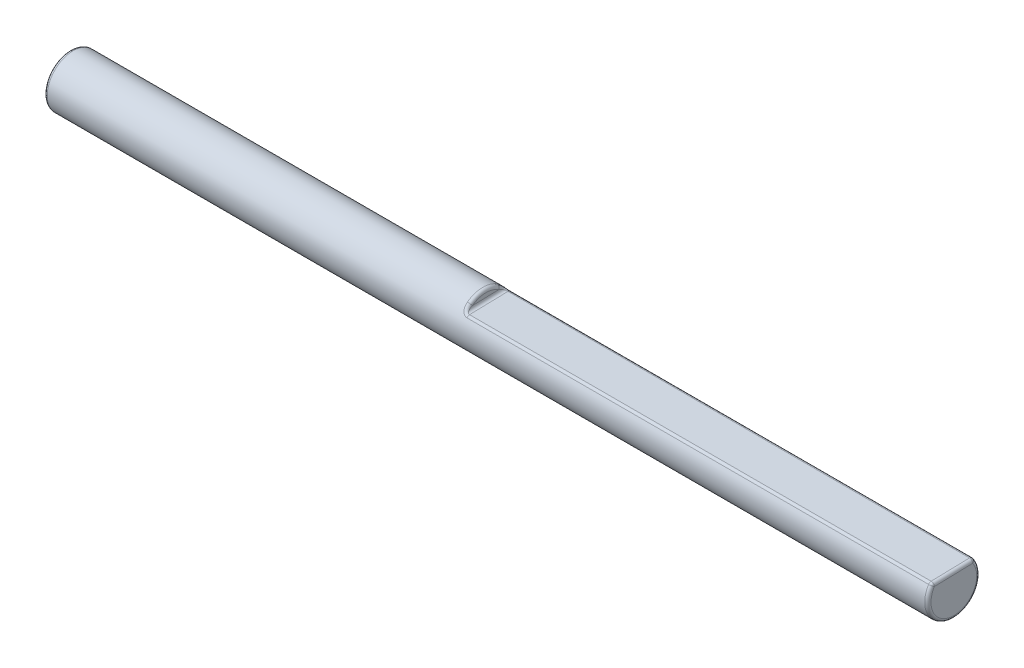
ISO-10303-21;
HEADER;
FILE_DESCRIPTION(('STEP AP214'),'2;1');
FILE_NAME('part.step','',(''),(''),'','','');
FILE_SCHEMA(('AUTOMOTIVE_DESIGN { 1 0 10303 214 1 1 1 1 }'));
ENDSEC;
DATA;
#1=APPLICATION_CONTEXT('core data for automotive mechanical design processes');
#2=APPLICATION_PROTOCOL_DEFINITION('international standard','automotive_design',2000,#1);
#3=PRODUCT_CONTEXT('',#1,'mechanical');
#4=PRODUCT('Part','Part','',(#3));
#5=PRODUCT_RELATED_PRODUCT_CATEGORY('part','',(#4));
#6=PRODUCT_DEFINITION_FORMATION('','',#4);
#7=PRODUCT_DEFINITION_CONTEXT('part definition',#1,'design');
#8=PRODUCT_DEFINITION('design','',#6,#7);
#9=PRODUCT_DEFINITION_SHAPE('','',#8);
#10=(LENGTH_UNIT() NAMED_UNIT(*) SI_UNIT(.MILLI.,.METRE.));
#11=(NAMED_UNIT(*) PLANE_ANGLE_UNIT() SI_UNIT($,.RADIAN.));
#12=(NAMED_UNIT(*) SI_UNIT($,.STERADIAN.) SOLID_ANGLE_UNIT());
#13=UNCERTAINTY_MEASURE_WITH_UNIT(LENGTH_MEASURE(1.E-05),#10,'distance_accuracy_value','');
#14=(GEOMETRIC_REPRESENTATION_CONTEXT(3) GLOBAL_UNCERTAINTY_ASSIGNED_CONTEXT((#13)) GLOBAL_UNIT_ASSIGNED_CONTEXT((#10,
#11,#12)) REPRESENTATION_CONTEXT('',''));
#15=CARTESIAN_POINT('',(0.,0.,0.));
#16=DIRECTION('',(0.,0.,1.));
#17=DIRECTION('',(1.,0.,0.));
#18=AXIS2_PLACEMENT_3D('',#15,#16,#17);
#19=CARTESIAN_POINT('',(107.95,0.,0.));
#20=DIRECTION('',(-1.,0.,0.));
#21=DIRECTION('',(0.,0.,1.));
#22=AXIS2_PLACEMENT_3D('',#19,#20,#21);
#23=CYLINDRICAL_SURFACE('',#22,3.175);
#24=CARTESIAN_POINT('',(0.381000000000006,0.,0.));
#25=DIRECTION('',(1.,0.,0.));
#26=DIRECTION('',(0.,0.,-1.));
#27=AXIS2_PLACEMENT_3D('',#24,#25,#26);
#28=CIRCLE('',#27,3.175);
#29=CARTESIAN_POINT('',(0.381000000000006,0.,-3.175));
#30=VERTEX_POINT('',#29);
#31=EDGE_CURVE('E297',#30,#30,#28,.T.);
#32=ORIENTED_EDGE('',*,*,#31,.T.);
#33=EDGE_LOOP('',(#32));
#34=FACE_BOUND('',#33,.T.);
#35=CARTESIAN_POINT('',(51.2889113464813,1.86061677622849,2.36945052063749));
#36=CARTESIAN_POINT('',(51.3264620396878,1.8664609920511,2.57606934951021));
#37=CARTESIAN_POINT('',(51.3968226929626,1.69924548178732,2.68201226556207));
#38=CARTESIAN_POINT('',(51.2716276856336,1.85531270441578,2.37616676666429));
#39=CARTESIAN_POINT('',(51.303375282423,1.85749105612046,2.58277024156461));
#40=CARTESIAN_POINT('',(51.3622553712666,1.68738842412367,2.68949626337339));
#41=CARTESIAN_POINT('',(51.253810924238,1.85128223441124,2.38121692365727));
#42=CARTESIAN_POINT('',(51.2793882237581,1.85068500253967,2.58781753681003));
#43=CARTESIAN_POINT('',(51.3266218484758,1.67837691595813,2.69512250049785));
#44=CARTESIAN_POINT('',(51.2176628451154,1.84587687221378,2.38795387459997));
#45=CARTESIAN_POINT('',(51.2306157818434,1.84157359403442,2.59454953766819));
#46=CARTESIAN_POINT('',(51.254325690231,1.66629032446794,2.70262711959848));
#47=CARTESIAN_POINT('',(51.1993321068419,1.84449910257518,2.38964431297881));
#48=CARTESIAN_POINT('',(51.2058012442463,1.83925197265389,2.59624634845099));
#49=CARTESIAN_POINT('',(51.2176642136843,1.66320880874467,2.70450956262816));
#50=CARTESIAN_POINT('',(51.1624786529568,1.84449552930852,2.38964534121022));
#51=CARTESIAN_POINT('',(51.1559427111945,1.83924541956583,2.59624879138466));
#52=CARTESIAN_POINT('',(51.143957305913,1.66320071994776,2.70451062871122));
#53=CARTESIAN_POINT('',(51.1439559089441,1.84589828072248,2.3879208611442));
#54=CARTESIAN_POINT('',(51.1308680865988,1.84160861468443,2.59451922324205));
#55=CARTESIAN_POINT('',(51.1069118178863,1.66633801200165,2.70259019769311));
#56=CARTESIAN_POINT('',(51.1074745013587,1.85142600111972,2.38104446763984));
#57=CARTESIAN_POINT('',(51.0816486169153,1.85092869396238,2.58764220598248));
#58=CARTESIAN_POINT('',(51.0339490027194,1.67869857779526,2.69493054907568));
#59=CARTESIAN_POINT('',(51.0895156565798,1.8555500860408,2.37589366728384));
#60=CARTESIAN_POINT('',(51.0574728002052,1.85789594340085,2.5824870818938));
#61=CARTESIAN_POINT('',(50.9980313131668,1.68791987506303,2.68919257165323));
#62=CARTESIAN_POINT('',(51.0547078075911,1.86628287038285,2.36224541373698));
#63=CARTESIAN_POINT('',(51.0109290954819,1.87606450098341,2.56887370326151));
#64=CARTESIAN_POINT('',(50.928415615175,1.71191094840253,2.67398282988706));
#65=CARTESIAN_POINT('',(51.0378561737102,1.87288541272295,2.35375625136794));
#66=CARTESIAN_POINT('',(50.9885283498056,1.88727939537419,2.56040524868403));
#67=CARTESIAN_POINT('',(50.8947123473936,1.72666697481243,2.66452031537807));
#68=CARTESIAN_POINT('',(51.0056058699795,1.88824233783816,2.33353659065094));
#69=CARTESIAN_POINT('',(50.9461400200386,1.91343730516875,2.54031499979632));
#70=CARTESIAN_POINT('',(50.8302117399579,1.76097448524634,2.641971655952));
#71=CARTESIAN_POINT('',(50.9902095857453,1.89700017172521,2.32180089007985));
#72=CARTESIAN_POINT('',(50.9261330136026,1.92842247979147,2.52865914842708));
#73=CARTESIAN_POINT('',(50.7994191715348,1.7805336600944,2.62887969517106));
#74=CARTESIAN_POINT('',(50.9607241196294,1.91655090994752,2.29484670019643));
#75=CARTESIAN_POINT('',(50.8885031415294,1.96198733713377,2.50200106090461));
#76=CARTESIAN_POINT('',(50.740448239213,1.82417519910743,2.59879421738565));
#77=CARTESIAN_POINT('',(50.9466938216674,1.92740079294856,2.27952725029035));
#78=CARTESIAN_POINT('',(50.8709667890501,1.98071569139524,2.48686134279981));
#79=CARTESIAN_POINT('',(50.7123876431477,1.84838410573956,2.58168754224174));
#80=CARTESIAN_POINT('',(50.92069636433,1.95044233090003,2.24590286258762));
#81=CARTESIAN_POINT('',(50.8394282094077,2.02063141439924,2.45378195785048));
#82=CARTESIAN_POINT('',(50.660392728466,1.89976428689574,2.54411811476548));
#83=CARTESIAN_POINT('',(50.90873157848,1.96263550345286,2.22759453657761));
#84=CARTESIAN_POINT('',(50.8254278039632,2.04188053771935,2.43578407032227));
#85=CARTESIAN_POINT('',(50.6364631569006,1.92693891165497,2.52365155349101));
#86=CARTESIAN_POINT('',(50.8827938803284,1.99264886394887,2.1808885782048));
#87=CARTESIAN_POINT('',(50.7964779101286,2.0944753687885,2.38998506591887));
#88=CARTESIAN_POINT('',(50.5845877607386,1.99378163171356,2.47140825448484));
#89=CARTESIAN_POINT('',(50.8697674359335,2.01085591234255,2.15129100670113));
#90=CARTESIAN_POINT('',(50.7832722093846,2.12660683697859,2.36102216723602));
#91=CARTESIAN_POINT('',(50.5585348718877,2.03429405335518,2.43827823086114));
#92=CARTESIAN_POINT('',(50.8474914781523,2.04782943375369,2.08793927786675));
#93=CARTESIAN_POINT('',(50.763655442702,2.1921565369996,2.29941171032207));
#94=CARTESIAN_POINT('',(50.5139829562839,2.11646998902107,2.36730788375925));
#95=CARTESIAN_POINT('',(50.8382463028738,2.06659652295876,2.05418040386822));
#96=CARTESIAN_POINT('',(50.7573419075053,2.22571762123843,2.26658152208576));
#97=CARTESIAN_POINT('',(50.4954926057465,2.1581347669446,2.32946221475156));
#98=CARTESIAN_POINT('',(50.8200767324406,2.11127559581753,1.96934888447875));
#99=CARTESIAN_POINT('',(50.7495916814408,2.30634325466988,2.18416014327291));
#100=CARTESIAN_POINT('',(50.4591534648827,2.25719798063517,2.23428957702656));
#101=CARTESIAN_POINT('',(50.8127131041597,2.13709014841927,1.91669422351017));
#102=CARTESIAN_POINT('',(50.7514088708258,2.35328761028631,2.1331392674937));
#103=CARTESIAN_POINT('',(50.4444262082862,2.31432941245922,2.17516089294884));
#104=CARTESIAN_POINT('',(50.8029629166156,2.18716484872636,1.80640004855309));
#105=CARTESIAN_POINT('',(50.7649453938521,2.44503082507211,2.02690729169339));
#106=CARTESIAN_POINT('',(50.4249258332647,2.42491686404693,2.05119042107963));
#107=CARTESIAN_POINT('',(50.8006063710277,2.21141478255827,1.74873261886379));
#108=CARTESIAN_POINT('',(50.7771512057677,2.48993644770661,1.97126510354332));
#109=CARTESIAN_POINT('',(50.4202127421912,2.47834887258039,1.9863165957711));
#110=CARTESIAN_POINT('',(50.7996997300512,2.25308918931056,1.64154501717415));
#111=CARTESIAN_POINT('',(50.8063065780548,2.5675813512571,1.86856339253273));
#112=CARTESIAN_POINT('',(50.4183994599932,2.56994052925047,1.86563624935162));
#113=CARTESIAN_POINT('',(50.8004940123679,2.27091978608572,1.59264377162257));
#114=CARTESIAN_POINT('',(50.8222093303457,2.60124831444893,1.82140194567038));
#115=CARTESIAN_POINT('',(50.4199880243634,2.60904074450168,1.81054522403829));
#116=CARTESIAN_POINT('',(50.8038892506501,2.30498944125461,1.49291444033795));
#117=CARTESIAN_POINT('',(50.8585085124755,2.66631382468721,1.72508979460887));
#118=CARTESIAN_POINT('',(50.4267785009295,2.68356961941779,1.69812625423315));
#119=CARTESIAN_POINT('',(50.8064925353414,2.32122641740139,1.44208395091787));
#120=CARTESIAN_POINT('',(50.8791200444994,2.69765457973563,1.67579499349746));
#121=CARTESIAN_POINT('',(50.4319850705777,2.718993478883,1.64079551644433));
#122=CARTESIAN_POINT('',(50.8129252595926,2.35173838787002,1.33979125008394));
#123=CARTESIAN_POINT('',(50.9236828364736,2.75740753118696,1.57615280226639));
#124=CARTESIAN_POINT('',(50.4448505192883,2.78536536104796,1.52535910882584));
#125=CARTESIAN_POINT('',(50.8167316771751,2.36604354938308,1.28835707996335));
#126=CARTESIAN_POINT('',(50.9477540223914,2.78579308492648,1.52569960894811));
#127=CARTESIAN_POINT('',(50.4524633544017,2.81638273242603,1.46728619497698));
#128=CARTESIAN_POINT('',(50.8251335397235,2.3929742143745,1.18429308388462));
#129=CARTESIAN_POINT('',(50.9988637336602,2.84029317299343,1.42251192748724));
#130=CARTESIAN_POINT('',(50.4692670793957,2.87456680695641,1.34973233304561));
#131=CARTESIAN_POINT('',(50.8297267183352,2.40560436247825,1.13166705892288));
#132=CARTESIAN_POINT('',(51.0260182991249,2.86629149250079,1.36970693172966));
#133=CARTESIAN_POINT('',(50.4784534365679,2.90174417233005,1.29025584106035));
#134=CARTESIAN_POINT('',(50.8345010351724,2.41740942277435,1.07845527244791));
#135=CARTESIAN_POINT('',(51.053542503335,2.89057483799126,1.31683559197639));
#136=CARTESIAN_POINT('',(50.4880020703448,2.92703004363376,1.23008947791018));
#137=(BOUNDED_SURFACE() B_SPLINE_SURFACE(3,2,((#35,#36,#37),(#38,#39,#40),(#41,#42,#43),(#44,
#45,#46),(#47,#48,#49),(#50,#51,#52),(#53,#54,#55),(#56,#57,#58),(#59,#60,#61),(#62,#63,#64),
(#65,#66,#67),(#68,#69,#70),(#71,#72,#73),(#74,#75,#76),(#77,#78,#79),(#80,#81,#82),(#83,#84,
#85),(#86,#87,#88),(#89,#90,#91),(#92,#93,#94),(#95,#96,#97),(#98,#99,#100),(#101,#102,#103),
(#104,#105,#106),(#107,#108,#109),(#110,#111,#112),(#113,#114,#115),(#116,#117,#118),(#119,#120,
#121),(#122,#123,#124),(#125,#126,#127),(#128,#129,#130),(#131,#132,#133),(#134,#135,#136)),
.UNSPECIFIED.,.F.,.F.,.F.) B_SPLINE_SURFACE_WITH_KNOTS((4,2,2,2,2,2,2,2,2,2,2,2,2,2,2,2,4),(3,
3),(0.,0.109979605014101,0.219839845237583,0.330834159910739,0.441792434311733,
0.552476866686738,0.663339696503116,0.777812327617677,0.892415638572016,1.05027319729736,
1.20831135545631,1.42859982924447,1.65020508343154,1.82836901100806,2.00676271461984,
2.18193077376075,2.35660247596007),(0.,1.),
.UNSPECIFIED.) GEOMETRIC_REPRESENTATION_ITEM() RATIONAL_B_SPLINE_SURFACE(((1.,0.875696525181189,
1.),(1.,0.876819204022841,1.),(1.,0.877647414738648,1.),(1.,0.87874140112617,1.),(1.,
0.87900778625312,1.),(1.,0.879006937081256,1.),(1.,0.878734165904822,1.),(1.,0.877621403045872,
1.),(1.,0.876781595570751,1.),(1.,0.874483221090066,1.),(1.,0.873026186281496,1.),(1.,
0.869421553804353,1.),(1.,0.867272846894886,1.),(1.,0.862141294560382,1.),(1.,0.859133566871117,
1.),(1.,0.852278123703959,1.),(1.,0.848429453231229,1.),(1.,0.838277208471231,1.),(1.,
0.831595334164917,1.),(1.,0.816756892948541,1.),(1.,0.808598647638926,1.),(1.,0.78754094815492,
1.),(1.,0.774039732630418,1.),(1.,0.745150665958184,1.),(1.,0.729752019803922,1.),(1.,
0.700926713202263,1.),(1.,0.687705220781478,1.),(1.,0.660816578297559,1.),(1.,0.647148875465996,
1.),(1.,0.619959656878175,1.),(1.,0.60643996640438,1.),(1.,0.579679073015139,1.),(1.,
0.566437189530008,1.),(1.,0.553482817324469,1.))) REPRESENTATION_ITEM('') SURFACE());
#138=CARTESIAN_POINT('',(50.4880020703448,2.92703004363376,1.23008947791018));
#139=CARTESIAN_POINT('',(50.4784534365679,2.90174417233005,1.29025584106035));
#140=CARTESIAN_POINT('',(50.4692670793957,2.87456680695641,1.34973233304561));
#141=CARTESIAN_POINT('',(50.4524633544017,2.81638273242603,1.46728619497698));
#142=CARTESIAN_POINT('',(50.4448505192883,2.78536536104796,1.52535910882584));
#143=CARTESIAN_POINT('',(50.4319850705777,2.71899347888301,1.64079551644433));
#144=CARTESIAN_POINT('',(50.4267785009295,2.68356961941779,1.69812625423315));
#145=CARTESIAN_POINT('',(50.4199880243634,2.60904074450168,1.81054522403829));
#146=CARTESIAN_POINT('',(50.4183994599932,2.56994052925047,1.86563624935162));
#147=CARTESIAN_POINT('',(50.4202127421912,2.47834887258039,1.9863165957711));
#148=CARTESIAN_POINT('',(50.4249258332647,2.42491686404693,2.05119042107963));
#149=CARTESIAN_POINT('',(50.4444262082862,2.31432941245922,2.17516089294884));
#150=CARTESIAN_POINT('',(50.4591534648827,2.25719798063517,2.23428957702656));
#151=CARTESIAN_POINT('',(50.4954926057465,2.1581347669446,2.32946221475156));
#152=CARTESIAN_POINT('',(50.5139829562839,2.11646998902107,2.36730788375925));
#153=CARTESIAN_POINT('',(50.5585348718877,2.03429405335518,2.43827823086114));
#154=CARTESIAN_POINT('',(50.5845877607386,1.99378163171356,2.47140825448484));
#155=CARTESIAN_POINT('',(50.6364631569006,1.92693891165497,2.52365155349101));
#156=CARTESIAN_POINT('',(50.660392728466,1.89976428689574,2.54411811476548));
#157=CARTESIAN_POINT('',(50.7123876431477,1.84838410573956,2.58168754224174));
#158=CARTESIAN_POINT('',(50.740448239213,1.82417519910743,2.59879421738565));
#159=CARTESIAN_POINT('',(50.7994191715348,1.7805336600944,2.62887969517106));
#160=CARTESIAN_POINT('',(50.8302117399579,1.76097448524634,2.641971655952));
#161=CARTESIAN_POINT('',(50.8947123473936,1.72666697481243,2.66452031537807));
#162=CARTESIAN_POINT('',(50.928415615175,1.71191094840253,2.67398282988706));
#163=CARTESIAN_POINT('',(50.9980313131668,1.68791987506303,2.68919257165323));
#164=CARTESIAN_POINT('',(51.0339490027194,1.67869857779526,2.69493054907568));
#165=CARTESIAN_POINT('',(51.1069118178863,1.66633801200165,2.70259019769311));
#166=CARTESIAN_POINT('',(51.143957305913,1.66320071994776,2.70451062871122));
#167=CARTESIAN_POINT('',(51.2176642136843,1.66320880874467,2.70450956262816));
#168=CARTESIAN_POINT('',(51.254325690231,1.66629032446794,2.70262711959848));
#169=CARTESIAN_POINT('',(51.3266218484758,1.67837691595813,2.69512250049785));
#170=CARTESIAN_POINT('',(51.3622553712666,1.68738842412367,2.68949626337339));
#171=CARTESIAN_POINT('',(51.3968226929626,1.69924548178732,2.68201226556207));
#172=B_SPLINE_CURVE_WITH_KNOTS('',3,(#138,#139,#140,#141,#142,#143,#144,#145,#146,#147,#148,
#149,#150,#151,#152,#153,#154,#155,#156,#157,#158,#159,#160,#161,#162,#163,#164,#165,#166,#167,
#168,#169,#170,#171),.UNSPECIFIED.,.F.,.F.,(4,2,2,2,2,2,2,2,2,2,2,2,2,2,2,2,4),(0.,
0.174671702199319,0.349839761340232,0.52823346495201,0.706397392528534,0.928002646715598,
1.14829112050376,1.30632927866271,1.46418683738806,1.5787901483424,1.69326277945696,
1.80412560927333,1.91481004164834,2.02576831604933,2.13676263072249,2.24662287094597,
2.35660247596007),.UNSPECIFIED.);
#173=CARTESIAN_POINT('',(50.419,2.55004648338834,1.89153057933484));
#174=VERTEX_POINT('',#173);
#175=CARTESIAN_POINT('',(51.181,1.66320478511395,2.70451009293255));
#176=VERTEX_POINT('',#175);
#177=EDGE_CURVE('E290',#174,#176,#172,.T.);
#178=ORIENTED_EDGE('',*,*,#177,.F.);
#179=CARTESIAN_POINT('',(50.419,0.,0.));
#180=DIRECTION('',(-1.,0.,0.));
#181=DIRECTION('',(0.,0.,1.));
#182=AXIS2_PLACEMENT_3D('',#179,#180,#181);
#183=CIRCLE('',#182,3.175);
#184=CARTESIAN_POINT('',(50.419,2.64280139391695,-1.75960955677975));
#185=VERTEX_POINT('',#184);
#186=EDGE_CURVE('E109',#174,#185,#183,.T.);
#187=ORIENTED_EDGE('',*,*,#186,.T.);
#188=CARTESIAN_POINT('',(50.8366905023827,2.47313278792479,-0.929790084784356));
#189=CARTESIAN_POINT('',(51.0664734733044,2.96369122443615,-1.14301851228131));
#190=CARTESIAN_POINT('',(50.4923810047653,2.99569537312775,-1.05187177518031));
#191=CARTESIAN_POINT('',(50.8319019684397,2.46437474302006,-0.983264972040821));
#192=CARTESIAN_POINT('',(51.0388431863217,2.94265705359688,-1.19707037018806));
#193=CARTESIAN_POINT('',(50.4828039368059,2.9742543950184,-1.11293055452863));
#194=CARTESIAN_POINT('',(50.8272624690788,2.45477757696794,-1.03621001373454));
#195=CARTESIAN_POINT('',(51.0115031225493,2.91994457885805,-1.25108863702687));
#196=CARTESIAN_POINT('',(50.4735249381208,2.95092222441763,-1.17341105694561));
#197=CARTESIAN_POINT('',(50.8186892705911,2.43388562169779,-1.14102346267586));
#198=CARTESIAN_POINT('',(50.9598467979093,2.87193959302793,-1.35678020802059));
#199=CARTESIAN_POINT('',(50.4563785412191,2.90043195384652,-1.29319680086037));
#200=CARTESIAN_POINT('',(50.8147573756501,2.42258662422196,-1.19288882775468));
#201=CARTESIAN_POINT('',(50.9354262066966,2.84677023994149,-1.40851008729006));
#202=CARTESIAN_POINT('',(50.4485147513741,2.87326438050473,-1.35249870452667));
#203=CARTESIAN_POINT('',(50.8079566034907,2.39803114103891,-1.29645583950263));
#204=CARTESIAN_POINT('',(50.8898623196213,2.79330806338998,-1.51110560413029));
#205=CARTESIAN_POINT('',(50.4349132069055,2.8144865549075,-1.47097282171677));
#206=CARTESIAN_POINT('',(50.8051148175835,2.38473496399274,-1.34812512319508));
#207=CARTESIAN_POINT('',(50.8686188962066,2.76503432555879,-1.56206901829057));
#208=CARTESIAN_POINT('',(50.4292296348989,2.78278705782587,-1.53010938050571));
#209=CARTESIAN_POINT('',(50.8011384346416,2.35644960446841,-1.44969228552826));
#210=CARTESIAN_POINT('',(50.8308901831387,2.70598038527811,-1.66187338182173));
#211=CARTESIAN_POINT('',(50.4212768690133,2.71559266983258,-1.64641708269041));
#212=CARTESIAN_POINT('',(50.8000019744405,2.34146228894075,-1.49959203917676));
#213=CARTESIAN_POINT('',(50.8141969196926,2.67527084306931,-1.71084799126658));
#214=CARTESIAN_POINT('',(50.4190039488012,2.68010196652802,-1.70359030428956));
#215=CARTESIAN_POINT('',(50.7999972238099,2.30345354349339,-1.61716285052348));
#216=CARTESIAN_POINT('',(50.7808943816749,2.59910537279674,-1.82523082391367));
#217=CARTESIAN_POINT('',(50.4189944477321,2.59035439555285,-1.83837622007862));
#218=CARTESIAN_POINT('',(50.8022373446047,2.27964097768128,-1.68382232215996));
#219=CARTESIAN_POINT('',(50.766210276487,2.55198508508872,-1.8908185457887));
#220=CARTESIAN_POINT('',(50.4234746892161,2.53432925583875,-1.91486146749265));
#221=CARTESIAN_POINT('',(50.8130834683634,2.2297090887604,-1.81076112732047));
#222=CARTESIAN_POINT('',(50.7507213830287,2.45497751815753,-2.01558647679361));
#223=CARTESIAN_POINT('',(50.4451669367202,2.4172221038779,-2.06064367928652));
#224=CARTESIAN_POINT('',(50.8216317880889,2.20361254448583,-1.87109265147976));
#225=CARTESIAN_POINT('',(50.7491923300968,2.40498959580597,-2.07538897589359));
#226=CARTESIAN_POINT('',(50.4622635762618,2.35619033931358,-2.12999933228784));
#227=CARTESIAN_POINT('',(50.841931751241,2.16135772100504,-1.96069216875758));
#228=CARTESIAN_POINT('',(50.7597988918809,2.32503752005264,-2.1646831757065));
#229=CARTESIAN_POINT('',(50.5028635024318,2.25760267407526,-2.2331016851402));
#230=CARTESIAN_POINT('',(50.8510161119943,2.14541948765644,-1.99270116650551));
#231=CARTESIAN_POINT('',(50.7665067335088,2.29530187505624,-2.19654788923173));
#232=CARTESIAN_POINT('',(50.5210322238258,2.22046763862043,-2.2699588237116));
#233=CARTESIAN_POINT('',(50.8725439006968,2.11390174586578,-2.05301756447317));
#234=CARTESIAN_POINT('',(50.7860729430861,2.23711937049072,-2.25663718827951));
#235=CARTESIAN_POINT('',(50.5640878013179,2.14711938041226,-2.33945367830609));
#236=CARTESIAN_POINT('',(50.8849895631031,2.09832248355702,-2.08132248372334));
#237=CARTESIAN_POINT('',(50.7988658365802,2.20856141987183,-2.2850125711189));
#238=CARTESIAN_POINT('',(50.5889791263305,2.1109067884488,-2.37208856612658));
#239=CARTESIAN_POINT('',(50.9135672484879,2.06823964868464,-2.13365896718704));
#240=CARTESIAN_POINT('',(50.8308512970163,2.15398855389044,-2.33751986989062));
#241=CARTESIAN_POINT('',(50.6461344968504,2.0410488499449,-2.43246808970737));
#242=CARTESIAN_POINT('',(50.9297340159478,2.05374803932415,-2.15764619565517));
#243=CARTESIAN_POINT('',(50.8500787265335,2.12786952256222,-2.36175791806184));
#244=CARTESIAN_POINT('',(50.678468031314,2.00743196280211,-2.46016196629496));
#245=CARTESIAN_POINT('',(50.9655460143898,2.02707924621252,-2.20021747230689));
#246=CARTESIAN_POINT('',(50.8944279737883,2.0802717739033,-2.4047987145019));
#247=CARTESIAN_POINT('',(50.7500920281881,1.94561243483343,-2.50933901244598));
#248=CARTESIAN_POINT('',(50.9851874844033,2.01489958929147,-2.21880730566401));
#249=CARTESIAN_POINT('',(50.9195598483639,2.05866695165713,-2.42372852510654));
#250=CARTESIAN_POINT('',(50.7893749686602,1.91740400807438,-2.53082883165927));
#251=CARTESIAN_POINT('',(51.0242849184163,1.99544826213891,-2.24772736525183));
#252=CARTESIAN_POINT('',(50.9705605778029,2.02442613620939,-2.45319434086187));
#253=CARTESIAN_POINT('',(50.8675698369576,1.87237635998464,-2.56427490238752));
#254=CARTESIAN_POINT('',(51.0433501238559,1.98771985118057,-2.25886680651986));
#255=CARTESIAN_POINT('',(50.9958022438088,2.01089078633314,-2.46459856468082));
#256=CARTESIAN_POINT('',(50.905700247744,1.85449608074485,-2.57716448670486));
#257=CARTESIAN_POINT('',(51.082987248131,1.97527835310497,-2.27655087496051));
#258=CARTESIAN_POINT('',(51.0486832725315,1.98920693919082,-2.48269898626542));
#259=CARTESIAN_POINT('',(50.9849744962274,1.82571888208067,-2.59763191682843));
#260=CARTESIAN_POINT('',(51.1035575481574,1.97056207790239,-2.2831003609211));
#261=CARTESIAN_POINT('',(51.0763622895416,1.98101447009375,-2.48943280879809));
#262=CARTESIAN_POINT('',(51.026115096306,1.81481457916767,-2.60521537952105));
#263=CARTESIAN_POINT('',(51.1428554608013,1.96486509340047,-2.29097794114208));
#264=CARTESIAN_POINT('',(51.1293797388771,1.97114341042692,-2.49752366762619));
#265=CARTESIAN_POINT('',(51.1047109216102,1.80164379466081,-2.6143373069388));
#266=CARTESIAN_POINT('',(51.1614979032267,1.96349577240607,-2.29284986576948));
#267=CARTESIAN_POINT('',(51.15461567683,1.96877450701537,-2.49945091695443));
#268=CARTESIAN_POINT('',(51.1419958064556,1.79847870003612,-2.61650537079105));
#269=CARTESIAN_POINT('',(51.198800323664,1.96341522144709,-2.29296003419046));
#270=CARTESIAN_POINT('',(51.2050815462412,1.9686350523109,-2.49956438992405));
#271=CARTESIAN_POINT('',(51.2166006473259,1.79829251030992,-2.61663296676295));
#272=CARTESIAN_POINT('',(51.2174603047176,1.9647046013986,-2.29119744421257));
#273=CARTESIAN_POINT('',(51.2303432902503,1.9708653804644,-2.49774989809651));
#274=CARTESIAN_POINT('',(51.2539206094347,1.80127282498867,-2.61459153320788));
#275=CARTESIAN_POINT('',(51.2535558495348,1.96978030577213,-2.28418358195071));
#276=CARTESIAN_POINT('',(51.2790431839511,1.97965862877354,-2.49054565618816));
#277=CARTESIAN_POINT('',(51.3261116990702,1.81300714649384,-2.60646966065092));
#278=CARTESIAN_POINT('',(51.2710113390765,1.97347575155864,-2.27905923384329));
#279=CARTESIAN_POINT('',(51.3025438737369,1.98607456474883,-2.48527719823452));
#280=CARTESIAN_POINT('',(51.3610226781532,1.82155101581374,-2.60053616854032));
#281=CARTESIAN_POINT('',(51.3049460682606,1.98305049522653,-2.26552764164808));
#282=CARTESIAN_POINT('',(51.3479419425349,2.00273634474729,-2.47142162312479));
#283=CARTESIAN_POINT('',(51.4288921365209,1.8436951655787,-2.58487321052664));
#284=CARTESIAN_POINT('',(51.3214252853435,1.98892984355043,-2.25712032173186));
#285=CARTESIAN_POINT('',(51.3698657559731,2.01300308331627,-2.46281679159412));
#286=CARTESIAN_POINT('',(51.4618505706864,1.85729556281653,-2.57514365694404));
#287=CARTESIAN_POINT('',(51.3371917565338,1.99578921052919,-2.24711140873195));
#288=CARTESIAN_POINT('',(51.3905745844236,2.0250108878266,-2.45261527789264));
#289=CARTESIAN_POINT('',(51.4933835130676,1.87316876284834,-2.56356466387903));
#290=(BOUNDED_SURFACE() B_SPLINE_SURFACE(3,2,((#188,#189,#190),(#191,#192,#193),(#194,#195,
#196),(#197,#198,#199),(#200,#201,#202),(#203,#204,#205),(#206,#207,#208),(#209,#210,#211),
(#212,#213,#214),(#215,#216,#217),(#218,#219,#220),(#221,#222,#223),(#224,#225,#226),(#227,#228,
#229),(#230,#231,#232),(#233,#234,#235),(#236,#237,#238),(#239,#240,#241),(#242,#243,#244),
(#245,#246,#247),(#248,#249,#250),(#251,#252,#253),(#254,#255,#256),(#257,#258,#259),(#260,#261,
#262),(#263,#264,#265),(#266,#267,#268),(#269,#270,#271),(#272,#273,#274),(#275,#276,#277),
(#278,#279,#280),(#281,#282,#283),(#284,#285,#286),(#287,#288,#289)),.UNSPECIFIED.,.F.,.F.,
.F.) B_SPLINE_SURFACE_WITH_KNOTS((4,2,2,2,2,2,2,2,2,2,2,2,2,2,2,2,4),(3,3),(0.,
0.173248836944608,0.346933335867547,0.524690929361412,0.70225417070621,0.951919480819183,
1.19932966387977,1.34732751797523,1.49542399824134,1.64496379912425,1.79434271967722,
1.92193480842236,2.04939162718749,2.16114701727452,2.27292804732529,2.3807144182394,
2.48850327889578),(0.,1.),
.UNSPECIFIED.) GEOMETRIC_REPRESENTATION_ITEM() RATIONAL_B_SPLINE_SURFACE(((1.,0.547606480192874,
1.),(1.,0.560359682932015,1.),(1.,0.573424936455796,1.),(1.,0.599879323130063,1.),(1.,
0.613269188109451,1.),(1.,0.640318570500402,1.),(1.,0.653977047742925,1.),(1.,0.680906548091395,
1.),(1.,0.694177978494561,1.),(1.,0.725285507307095,1.),(1.,0.742786852814231,1.),(1.,
0.775341861423871,1.),(1.,0.790416205566558,1.),(1.,0.811926405637071,1.),(1.,0.819399514188753,
1.),(1.,0.833048896557436,1.),(1.,0.839224302841506,1.),(1.,0.850224407389941,1.),(1.,
0.855035355360919,1.),(1.,0.86323283357083,1.),(1.,0.866620890681609,1.),(1.,0.871698951997393,
1.),(1.,0.873564545316049,1.),(1.,0.876457776981406,1.),(1.,0.877486301610389,1.),(1.,
0.87871348011476,1.),(1.,0.878998757213615,1.),(1.,0.879015583797091,1.),(1.,0.878747006225343,
1.),(1.,0.877655652456154,1.),(1.,0.876853024358936,1.),(1.,0.874661101921426,1.),(1.,
0.873271794030241,1.),(1.,0.871562708712588,1.))) REPRESENTATION_ITEM('') SURFACE());
#291=CARTESIAN_POINT('',(51.4933835130676,1.87316876284834,-2.56356466387903));
#292=CARTESIAN_POINT('',(51.4618505706864,1.85729556281653,-2.57514365694404));
#293=CARTESIAN_POINT('',(51.4288921365209,1.8436951655787,-2.58487321052664));
#294=CARTESIAN_POINT('',(51.3610226781532,1.82155101581374,-2.60053616854032));
#295=CARTESIAN_POINT('',(51.3261116990702,1.81300714649384,-2.60646966065092));
#296=CARTESIAN_POINT('',(51.2539206094347,1.80127282498867,-2.61459153320788));
#297=CARTESIAN_POINT('',(51.2166006473259,1.79829251030992,-2.61663296676295));
#298=CARTESIAN_POINT('',(51.1419958064556,1.79847870003612,-2.61650537079105));
#299=CARTESIAN_POINT('',(51.1047109216102,1.80164379466081,-2.6143373069388));
#300=CARTESIAN_POINT('',(51.026115096306,1.81481457916767,-2.60521537952105));
#301=CARTESIAN_POINT('',(50.9849744962274,1.82571888208067,-2.59763191682843));
#302=CARTESIAN_POINT('',(50.905700247744,1.85449608074485,-2.57716448670486));
#303=CARTESIAN_POINT('',(50.8675698369576,1.87237635998464,-2.56427490238752));
#304=CARTESIAN_POINT('',(50.7893749686602,1.91740400807438,-2.53082883165927));
#305=CARTESIAN_POINT('',(50.7500920281881,1.94561243483343,-2.50933901244598));
#306=CARTESIAN_POINT('',(50.678468031314,2.00743196280211,-2.46016196629496));
#307=CARTESIAN_POINT('',(50.6461344968504,2.0410488499449,-2.43246808970737));
#308=CARTESIAN_POINT('',(50.5889791263305,2.1109067884488,-2.37208856612658));
#309=CARTESIAN_POINT('',(50.5640878013179,2.14711938041226,-2.33945367830609));
#310=CARTESIAN_POINT('',(50.5210322238258,2.22046763862043,-2.2699588237116));
#311=CARTESIAN_POINT('',(50.5028635024318,2.25760267407526,-2.2331016851402));
#312=CARTESIAN_POINT('',(50.4622635762618,2.35619033931357,-2.12999933228784));
#313=CARTESIAN_POINT('',(50.4451669367202,2.4172221038779,-2.06064367928652));
#314=CARTESIAN_POINT('',(50.4234746892161,2.53432925583875,-1.91486146749265));
#315=CARTESIAN_POINT('',(50.4189944477321,2.59035439555285,-1.83837622007862));
#316=CARTESIAN_POINT('',(50.4190039488012,2.68010196652802,-1.70359030428956));
#317=CARTESIAN_POINT('',(50.4212768690133,2.71559266983258,-1.64641708269041));
#318=CARTESIAN_POINT('',(50.4292296348989,2.78278705782587,-1.53010938050571));
#319=CARTESIAN_POINT('',(50.4349132069055,2.8144865549075,-1.47097282171677));
#320=CARTESIAN_POINT('',(50.4485147513741,2.87326438050473,-1.35249870452667));
#321=CARTESIAN_POINT('',(50.4563785412191,2.90043195384652,-1.29319680086037));
#322=CARTESIAN_POINT('',(50.4735249381208,2.95092222441763,-1.17341105694561));
#323=CARTESIAN_POINT('',(50.4828039368059,2.9742543950184,-1.11293055452863));
#324=CARTESIAN_POINT('',(50.4923810047653,2.99569537312775,-1.05187177518031));
#325=B_SPLINE_CURVE_WITH_KNOTS('',3,(#291,#292,#293,#294,#295,#296,#297,#298,#299,#300,#301,
#302,#303,#304,#305,#306,#307,#308,#309,#310,#311,#312,#313,#314,#315,#316,#317,#318,#319,#320,
#321,#322,#323,#324),.UNSPECIFIED.,.F.,.F.,(4,2,2,2,2,2,2,2,2,2,2,2,2,2,2,2,4),(0.,
0.107788860656389,0.215575231570491,0.327356261621264,0.43911165170829,0.566568470473421,
0.694160559218561,0.84353947977153,0.993079280654447,1.14117576092056,1.28917361501601,
1.5365837980766,1.78624910818957,1.96381234953437,2.14156994302824,2.31525444195118,
2.48850327889578),.UNSPECIFIED.);
#326=CARTESIAN_POINT('',(51.181,1.79838348211942,-2.61657062798619));
#327=VERTEX_POINT('',#326);
#328=EDGE_CURVE('E148',#327,#185,#325,.T.);
#329=ORIENTED_EDGE('',*,*,#328,.F.);
#330=DIRECTION('',(-1.,0.,0.));
#331=VECTOR('',#330,1.);
#332=CARTESIAN_POINT('',(107.95,1.79838348211942,-2.61657062798619));
#333=LINE('',#332,#331);
#334=CARTESIAN_POINT('',(107.569,1.79838348211942,-2.61657062798619));
#335=VERTEX_POINT('',#334);
#336=EDGE_CURVE('E145',#327,#335,#333,.F.);
#337=ORIENTED_EDGE('',*,*,#336,.T.);
#338=CARTESIAN_POINT('',(107.569,0.,0.));
#339=DIRECTION('',(1.,0.,0.));
#340=DIRECTION('',(0.,0.,-1.));
#341=AXIS2_PLACEMENT_3D('',#338,#339,#340);
#342=CIRCLE('',#341,3.175);
#343=CARTESIAN_POINT('',(107.569,1.66320478511395,2.70451009293255));
#344=VERTEX_POINT('',#343);
#345=EDGE_CURVE('E137',#335,#344,#342,.F.);
#346=ORIENTED_EDGE('',*,*,#345,.T.);
#347=DIRECTION('',(-1.,0.,0.));
#348=VECTOR('',#347,1.);
#349=CARTESIAN_POINT('',(107.95,1.66320478511395,2.70451009293255));
#350=LINE('',#349,#348);
#351=EDGE_CURVE('E140',#344,#176,#350,.T.);
#352=ORIENTED_EDGE('',*,*,#351,.T.);
#353=EDGE_LOOP('',(#178,#187,#329,#337,#346,#352));
#354=FACE_BOUND('',#353,.T.);
#355=ADVANCED_FACE('F39',(#34,#354),#23,.T.);
#356=CARTESIAN_POINT('',(107.95,0.,0.));
#357=DIRECTION('',(1.,0.,0.));
#358=DIRECTION('',(0.,0.,-1.));
#359=AXIS2_PLACEMENT_3D('',#356,#357,#358);
#360=PLANE('',#359);
#361=CARTESIAN_POINT('',(107.95,0.,0.));
#362=DIRECTION('',(1.,0.,0.));
#363=DIRECTION('',(0.,0.,-1.));
#364=AXIS2_PLACEMENT_3D('',#361,#362,#363);
#365=CIRCLE('',#364,2.794);
#366=CARTESIAN_POINT('',(107.95,1.46362021089986,2.37996888178091));
#367=VERTEX_POINT('',#366);
#368=CARTESIAN_POINT('',(107.95,1.58257746426468,-2.30258215262812));
#369=VERTEX_POINT('',#368);
#370=EDGE_CURVE('E49',#367,#369,#365,.T.);
#371=ORIENTED_EDGE('',*,*,#370,.T.);
#372=DIRECTION('',(0.,0.0253961749971585,-0.999677465133387));
#373=VECTOR('',#372,1.);
#374=CARTESIAN_POINT('',(107.95,1.45858474981178,2.57818128885724));
#375=LINE('',#374,#373);
#376=EDGE_CURVE('E11',#369,#367,#375,.F.);
#377=ORIENTED_EDGE('',*,*,#376,.T.);
#378=EDGE_LOOP('',(#371,#377));
#379=FACE_BOUND('',#378,.T.);
#380=ADVANCED_FACE('F165',(#379),#360,.T.);
#381=CARTESIAN_POINT('',(0.,0.,0.));
#382=DIRECTION('',(1.,0.,0.));
#383=DIRECTION('',(0.,0.,-1.));
#384=AXIS2_PLACEMENT_3D('',#381,#382,#383);
#385=PLANE('',#384);
#386=CARTESIAN_POINT('',(0.,0.,0.));
#387=DIRECTION('',(1.,0.,0.));
#388=DIRECTION('',(0.,0.,-1.));
#389=AXIS2_PLACEMENT_3D('',#386,#387,#388);
#390=CIRCLE('',#389,2.794);
#391=CARTESIAN_POINT('',(0.,0.,-2.794));
#392=VERTEX_POINT('',#391);
#393=EDGE_CURVE('E301',#392,#392,#390,.F.);
#394=ORIENTED_EDGE('',*,*,#393,.T.);
#395=EDGE_LOOP('',(#394));
#396=FACE_BOUND('',#395,.T.);
#397=ADVANCED_FACE('F167',(#396),#385,.F.);
#398=CARTESIAN_POINT('',(50.8,1.8394618640276,2.58785723153116));
#399=DIRECTION('',(0.,-0.999677465133387,-0.0253961749971585));
#400=DIRECTION('',(0.,0.0253961749971585,-0.999677465133387));
#401=AXIS2_PLACEMENT_3D('',#398,#399,#400);
#402=PLANE('',#401);
#403=DIRECTION('',(-1.,0.,0.));
#404=VECTOR('',#403,1.);
#405=CARTESIAN_POINT('',(50.8,1.96345457848091,-2.29290620995393));
#406=LINE('',#405,#404);
#407=CARTESIAN_POINT('',(107.569,1.96345457848091,-2.29290620995393));
#408=VERTEX_POINT('',#407);
#409=CARTESIAN_POINT('',(51.181,1.96345457848091,-2.29290620995393));
#410=VERTEX_POINT('',#409);
#411=EDGE_CURVE('E259',#408,#410,#406,.T.);
#412=ORIENTED_EDGE('',*,*,#411,.T.);
#413=DIRECTION('',(0.,0.0253961749971585,-0.999677465133387));
#414=VECTOR('',#413,1.);
#415=CARTESIAN_POINT('',(51.181,1.8394618640276,2.58785723153116));
#416=LINE('',#415,#414);
#417=CARTESIAN_POINT('',(51.181,1.8444973251161,2.38964482445456));
#418=VERTEX_POINT('',#417);
#419=EDGE_CURVE('E245',#410,#418,#416,.F.);
#420=ORIENTED_EDGE('',*,*,#419,.T.);
#421=DIRECTION('',(-1.,0.,0.));
#422=VECTOR('',#421,1.);
#423=CARTESIAN_POINT('',(50.8,1.8444973251161,2.38964482445456));
#424=LINE('',#423,#422);
#425=CARTESIAN_POINT('',(107.569,1.8444973251161,2.38964482445456));
#426=VERTEX_POINT('',#425);
#427=EDGE_CURVE('E263',#418,#426,#424,.F.);
#428=ORIENTED_EDGE('',*,*,#427,.T.);
#429=DIRECTION('',(0.,0.0253961749971585,-0.999677465133387));
#430=VECTOR('',#429,1.);
#431=CARTESIAN_POINT('',(107.569,1.9684900395694,-2.49111861703052));
#432=LINE('',#431,#430);
#433=EDGE_CURVE('E236',#426,#408,#432,.T.);
#434=ORIENTED_EDGE('',*,*,#433,.T.);
#435=EDGE_LOOP('',(#412,#420,#428,#434));
#436=FACE_BOUND('',#435,.T.);
#437=ADVANCED_FACE('F230',(#436),#402,.F.);
#438=CARTESIAN_POINT('',(50.8,0.,0.));
#439=DIRECTION('',(-1.,0.,0.));
#440=DIRECTION('',(0.,0.,1.));
#441=AXIS2_PLACEMENT_3D('',#438,#439,#440);
#442=PLANE('',#441);
#443=DIRECTION('',(0.,0.0253961749971585,-0.999677465133387));
#444=VECTOR('',#443,1.);
#445=CARTESIAN_POINT('',(50.8,2.34936715378523,-2.4814426743566));
#446=LINE('',#445,#444);
#447=CARTESIAN_POINT('',(50.8,2.24404090538174,1.66454690981466));
#448=VERTEX_POINT('',#447);
#449=CARTESIAN_POINT('',(50.8,2.32566522664691,-1.54845640996618));
#450=VERTEX_POINT('',#449);
#451=EDGE_CURVE('E128',#448,#450,#446,.T.);
#452=ORIENTED_EDGE('',*,*,#451,.T.);
#453=CARTESIAN_POINT('',(50.8,0.,0.));
#454=DIRECTION('',(-1.,0.,0.));
#455=DIRECTION('',(0.,0.,1.));
#456=AXIS2_PLACEMENT_3D('',#453,#454,#455);
#457=CIRCLE('',#456,2.794);
#458=EDGE_CURVE('E107',#450,#448,#457,.F.);
#459=ORIENTED_EDGE('',*,*,#458,.T.);
#460=EDGE_LOOP('',(#452,#459));
#461=FACE_BOUND('',#460,.T.);
#462=ADVANCED_FACE('F135',(#461),#442,.F.);
#463=CARTESIAN_POINT('',(107.569,1.45858474981178,2.57818128885724));
#464=DIRECTION('',(0.,-0.0253961749971585,0.999677465133387));
#465=DIRECTION('',(0.,-0.999677465133387,-0.0253961749971585));
#466=AXIS2_PLACEMENT_3D('',#463,#464,#465);
#467=CYLINDRICAL_SURFACE('',#466,0.381);
#468=CARTESIAN_POINT('',(107.569,1.46362021090026,2.37996888178155));
#469=DIRECTION('',(0.,-0.0253961749947785,0.999677465133447));
#470=DIRECTION('',(0.,-0.999677465133447,-0.0253961749947785));
#471=AXIS2_PLACEMENT_3D('',#468,#469,#470);
#472=CIRCLE('',#471,0.381);
#473=EDGE_CURVE('E233',#367,#426,#472,.T.);
#474=ORIENTED_EDGE('',*,*,#473,.F.);
#475=ORIENTED_EDGE('',*,*,#376,.F.);
#476=CARTESIAN_POINT('',(107.569,1.58257746426509,-2.30258215262785));
#477=DIRECTION('',(-2.37974909741498E-12,0.0253961749971586,-0.999677465133387));
#478=DIRECTION('',(0.,0.999677465133387,0.0253961749971586));
#479=AXIS2_PLACEMENT_3D('',#476,#477,#478);
#480=CIRCLE('',#479,0.381);
#481=EDGE_CURVE('E239',#408,#369,#480,.T.);
#482=ORIENTED_EDGE('',*,*,#481,.F.);
#483=ORIENTED_EDGE('',*,*,#433,.F.);
#484=EDGE_LOOP('',(#474,#475,#482,#483));
#485=FACE_BOUND('',#484,.T.);
#486=ADVANCED_FACE('F223',(#485),#467,.T.);
#487=CARTESIAN_POINT('',(107.569,0.,0.));
#488=DIRECTION('',(1.,0.,0.));
#489=DIRECTION('',(0.,0.,-1.));
#490=AXIS2_PLACEMENT_3D('',#487,#488,#489);
#491=TOROIDAL_SURFACE('',#490,2.794,0.381);
#492=CARTESIAN_POINT('',(107.569,1.58257746426468,-2.30258215262812));
#493=DIRECTION('',(0.,0.824116733223262,0.566419994369389));
#494=DIRECTION('',(0.,-0.566419994369389,0.824116733223262));
#495=AXIS2_PLACEMENT_3D('',#492,#493,#494);
#496=CIRCLE('',#495,0.381);
#497=EDGE_CURVE('E43',#369,#335,#496,.T.);
#498=ORIENTED_EDGE('',*,*,#497,.F.);
#499=ORIENTED_EDGE('',*,*,#370,.F.);
#500=CARTESIAN_POINT('',(107.569,1.46362021090028,2.37996888178065));
#501=DIRECTION('',(1.29804931960711E-12,0.851814202498442,-0.523844026807544));
#502=DIRECTION('',(0.,0.523844026807544,0.851814202498442));
#503=AXIS2_PLACEMENT_3D('',#500,#501,#502);
#504=CIRCLE('',#503,0.381);
#505=EDGE_CURVE('E62',#344,#367,#504,.T.);
#506=ORIENTED_EDGE('',*,*,#505,.F.);
#507=ORIENTED_EDGE('',*,*,#345,.F.);
#508=EDGE_LOOP('',(#498,#499,#506,#507));
#509=FACE_BOUND('',#508,.T.);
#510=ADVANCED_FACE('F220',(#509),#491,.T.);
#511=CARTESIAN_POINT('',(107.569,1.58257746426509,-2.30258215262785));
#512=DIRECTION('',(0.,0.,1.));
#513=DIRECTION('',(1.,0.,0.));
#514=AXIS2_PLACEMENT_3D('',#511,#512,#513);
#515=SPHERICAL_SURFACE('',#514,0.381);
#516=ORIENTED_EDGE('',*,*,#481,.T.);
#517=ORIENTED_EDGE('',*,*,#497,.T.);
#518=CARTESIAN_POINT('',(107.569,1.58257746426509,-2.30258215262785));
#519=DIRECTION('',(1.,0.,0.));
#520=DIRECTION('',(0.,0.,-1.));
#521=AXIS2_PLACEMENT_3D('',#518,#519,#520);
#522=CIRCLE('',#521,0.381);
#523=EDGE_CURVE('E309',#408,#335,#522,.F.);
#524=ORIENTED_EDGE('',*,*,#523,.F.);
#525=EDGE_LOOP('',(#516,#517,#524));
#526=FACE_BOUND('',#525,.T.);
#527=ADVANCED_FACE('F217',(#526),#515,.T.);
#528=CARTESIAN_POINT('',(107.569,1.46362021090028,2.37996888178065));
#529=DIRECTION('',(0.,0.,1.));
#530=DIRECTION('',(1.,0.,0.));
#531=AXIS2_PLACEMENT_3D('',#528,#529,#530);
#532=SPHERICAL_SURFACE('',#531,0.381);
#533=ORIENTED_EDGE('',*,*,#505,.T.);
#534=ORIENTED_EDGE('',*,*,#473,.T.);
#535=CARTESIAN_POINT('',(107.569,1.46362021090028,2.37996888178065));
#536=DIRECTION('',(1.,0.,0.));
#537=DIRECTION('',(0.,0.,-1.));
#538=AXIS2_PLACEMENT_3D('',#535,#536,#537);
#539=CIRCLE('',#538,0.381);
#540=EDGE_CURVE('E270',#344,#426,#539,.F.);
#541=ORIENTED_EDGE('',*,*,#540,.F.);
#542=EDGE_LOOP('',(#533,#534,#541));
#543=FACE_BOUND('',#542,.T.);
#544=ADVANCED_FACE('F213',(#543),#532,.T.);
#545=CARTESIAN_POINT('',(107.95,1.58257746426509,-2.30258215262785));
#546=DIRECTION('',(-1.,0.,0.));
#547=DIRECTION('',(0.,0.,1.));
#548=AXIS2_PLACEMENT_3D('',#545,#546,#547);
#549=CYLINDRICAL_SURFACE('',#548,0.381);
#550=ORIENTED_EDGE('',*,*,#523,.T.);
#551=ORIENTED_EDGE('',*,*,#336,.F.);
#552=CARTESIAN_POINT('',(51.181,1.58257746426509,-2.30258215262785));
#553=DIRECTION('',(-1.,0.,0.));
#554=DIRECTION('',(0.,0.,1.));
#555=AXIS2_PLACEMENT_3D('',#552,#553,#554);
#556=CIRCLE('',#555,0.381);
#557=EDGE_CURVE('E203',#410,#327,#556,.T.);
#558=ORIENTED_EDGE('',*,*,#557,.F.);
#559=ORIENTED_EDGE('',*,*,#411,.F.);
#560=EDGE_LOOP('',(#550,#551,#558,#559));
#561=FACE_BOUND('',#560,.T.);
#562=ADVANCED_FACE('F210',(#561),#549,.T.);
#563=CARTESIAN_POINT('',(51.181,2.28485306601432,0.0580452499242357));
#564=DIRECTION('',(0.,-0.0253961749971585,0.999677465133387));
#565=DIRECTION('',(0.,-0.999677465133387,-0.0253961749971585));
#566=AXIS2_PLACEMENT_3D('',#563,#564,#565);
#567=CYLINDRICAL_SURFACE('',#566,0.381);
#568=CARTESIAN_POINT('',(51.2889113464813,1.86061677622849,2.36945052063749));
#569=CARTESIAN_POINT('',(51.2716276856336,1.85531270441578,2.37616676666429));
#570=CARTESIAN_POINT('',(51.253810924238,1.85128223441124,2.38121692365727));
#571=CARTESIAN_POINT('',(51.2176628451154,1.84587687221378,2.38795387459997));
#572=CARTESIAN_POINT('',(51.1993321068419,1.84449910257518,2.38964431297881));
#573=CARTESIAN_POINT('',(51.1624786529568,1.84449552930852,2.38964534121022));
#574=CARTESIAN_POINT('',(51.1439559089441,1.84589828072248,2.3879208611442));
#575=CARTESIAN_POINT('',(51.1074745013587,1.85142600111972,2.38104446763984));
#576=CARTESIAN_POINT('',(51.0895156565798,1.8555500860408,2.37589366728384));
#577=CARTESIAN_POINT('',(51.0547078075911,1.86628287038285,2.36224541373698));
#578=CARTESIAN_POINT('',(51.0378561737102,1.87288541272295,2.35375625136794));
#579=CARTESIAN_POINT('',(51.0056058699795,1.88824233783816,2.33353659065094));
#580=CARTESIAN_POINT('',(50.9902095857453,1.89700017172521,2.32180089007985));
#581=CARTESIAN_POINT('',(50.9607241196294,1.91655090994752,2.29484670019643));
#582=CARTESIAN_POINT('',(50.9466938216674,1.92740079294856,2.27952725029035));
#583=CARTESIAN_POINT('',(50.92069636433,1.95044233090003,2.24590286258762));
#584=CARTESIAN_POINT('',(50.90873157848,1.96263550345286,2.22759453657761));
#585=CARTESIAN_POINT('',(50.8827938803284,1.99264886394887,2.1808885782048));
#586=CARTESIAN_POINT('',(50.8697674359335,2.01085591234255,2.15129100670113));
#587=CARTESIAN_POINT('',(50.8474914781523,2.04782943375369,2.08793927786675));
#588=CARTESIAN_POINT('',(50.8382463028737,2.06659652295876,2.05418040386822));
#589=CARTESIAN_POINT('',(50.8200767324406,2.11127559581753,1.96934888447875));
#590=CARTESIAN_POINT('',(50.8127131041597,2.13709014841927,1.91669422351017));
#591=CARTESIAN_POINT('',(50.8029629166156,2.18716484872636,1.80640004855309));
#592=CARTESIAN_POINT('',(50.8006063710277,2.21141478255827,1.74873261886379));
#593=CARTESIAN_POINT('',(50.7996997300512,2.25308918931056,1.64154501717415));
#594=CARTESIAN_POINT('',(50.8004940123679,2.27091978608572,1.59264377162257));
#595=CARTESIAN_POINT('',(50.8038892506501,2.30498944125461,1.49291444033795));
#596=CARTESIAN_POINT('',(50.8064925353414,2.32122641740139,1.44208395091787));
#597=CARTESIAN_POINT('',(50.8129252595926,2.35173838787002,1.33979125008394));
#598=CARTESIAN_POINT('',(50.8167316771751,2.36604354938308,1.28835707996335));
#599=CARTESIAN_POINT('',(50.8251335397235,2.3929742143745,1.18429308388462));
#600=CARTESIAN_POINT('',(50.8297267183352,2.40560436247825,1.13166705892288));
#601=CARTESIAN_POINT('',(50.8345010351724,2.41740942277435,1.07845527244791));
#602=B_SPLINE_CURVE_WITH_KNOTS('',3,(#568,#569,#570,#571,#572,#573,#574,#575,#576,#577,#578,
#579,#580,#581,#582,#583,#584,#585,#586,#587,#588,#589,#590,#591,#592,#593,#594,#595,#596,#597,
#598,#599,#600,#601),.UNSPECIFIED.,.F.,.F.,(4,2,2,2,2,2,2,2,2,2,2,2,2,2,2,2,4),(0.,
0.109979605014101,0.219839845237583,0.330834159910739,0.441792434311733,0.552476866686738,
0.663339696503116,0.777812327617677,0.892415638572016,1.05027319729736,1.20831135545631,
1.42859982924447,1.65020508343154,1.82836901100806,2.00676271461984,2.18193077376075,
2.35660247596007),.UNSPECIFIED.);
#603=EDGE_CURVE('E116',#418,#448,#602,.T.);
#604=ORIENTED_EDGE('',*,*,#603,.F.);
#605=ORIENTED_EDGE('',*,*,#419,.F.);
#606=CARTESIAN_POINT('',(50.8366905023827,2.47313278792479,-0.929790084784356));
#607=CARTESIAN_POINT('',(50.8319019684397,2.46437474302006,-0.983264972040821));
#608=CARTESIAN_POINT('',(50.8272624690788,2.45477757696794,-1.03621001373454));
#609=CARTESIAN_POINT('',(50.8186892705911,2.43388562169779,-1.14102346267586));
#610=CARTESIAN_POINT('',(50.8147573756501,2.42258662422196,-1.19288882775468));
#611=CARTESIAN_POINT('',(50.8079566034907,2.39803114103891,-1.29645583950263));
#612=CARTESIAN_POINT('',(50.8051148175835,2.38473496399274,-1.34812512319508));
#613=CARTESIAN_POINT('',(50.8011384346416,2.35644960446841,-1.44969228552826));
#614=CARTESIAN_POINT('',(50.8000019744405,2.34146228894075,-1.49959203917676));
#615=CARTESIAN_POINT('',(50.7999972238099,2.30345354349339,-1.61716285052348));
#616=CARTESIAN_POINT('',(50.8022373446047,2.27964097768128,-1.68382232215996));
#617=CARTESIAN_POINT('',(50.8130834683634,2.2297090887604,-1.81076112732047));
#618=CARTESIAN_POINT('',(50.821631788089,2.20361254448583,-1.87109265147976));
#619=CARTESIAN_POINT('',(50.841931751241,2.16135772100504,-1.96069216875758));
#620=CARTESIAN_POINT('',(50.8510161119943,2.14541948765644,-1.99270116650551));
#621=CARTESIAN_POINT('',(50.8725439006968,2.11390174586578,-2.05301756447317));
#622=CARTESIAN_POINT('',(50.8849895631031,2.09832248355702,-2.08132248372334));
#623=CARTESIAN_POINT('',(50.913567248488,2.06823964868464,-2.13365896718704));
#624=CARTESIAN_POINT('',(50.9297340159478,2.05374803932415,-2.15764619565517));
#625=CARTESIAN_POINT('',(50.9655460143898,2.02707924621252,-2.20021747230689));
#626=CARTESIAN_POINT('',(50.9851874844033,2.01489958929147,-2.21880730566401));
#627=CARTESIAN_POINT('',(51.0242849184163,1.99544826213891,-2.24772736525183));
#628=CARTESIAN_POINT('',(51.0433501238559,1.98771985118057,-2.25886680651986));
#629=CARTESIAN_POINT('',(51.082987248131,1.97527835310497,-2.27655087496051));
#630=CARTESIAN_POINT('',(51.1035575481574,1.97056207790239,-2.2831003609211));
#631=CARTESIAN_POINT('',(51.1428554608013,1.96486509340047,-2.29097794114208));
#632=CARTESIAN_POINT('',(51.1614979032267,1.96349577240607,-2.29284986576948));
#633=CARTESIAN_POINT('',(51.198800323664,1.96341522144709,-2.29296003419046));
#634=CARTESIAN_POINT('',(51.2174603047176,1.9647046013986,-2.29119744421257));
#635=CARTESIAN_POINT('',(51.2535558495348,1.96978030577213,-2.28418358195071));
#636=CARTESIAN_POINT('',(51.2710113390765,1.97347575155864,-2.27905923384329));
#637=CARTESIAN_POINT('',(51.3049460682606,1.98305049522653,-2.26552764164808));
#638=CARTESIAN_POINT('',(51.3214252853435,1.98892984355043,-2.25712032173186));
#639=CARTESIAN_POINT('',(51.3371917565338,1.99578921052919,-2.24711140873195));
#640=B_SPLINE_CURVE_WITH_KNOTS('',3,(#606,#607,#608,#609,#610,#611,#612,#613,#614,#615,#616,
#617,#618,#619,#620,#621,#622,#623,#624,#625,#626,#627,#628,#629,#630,#631,#632,#633,#634,#635,
#636,#637,#638,#639),.UNSPECIFIED.,.F.,.F.,(4,2,2,2,2,2,2,2,2,2,2,2,2,2,2,2,4),(0.,
0.173248836944608,0.346933335867547,0.524690929361412,0.70225417070621,0.951919480819183,
1.19932966387977,1.34732751797523,1.49542399824134,1.64496379912425,1.79434271967722,
1.92193480842236,2.04939162718749,2.16114701727452,2.27292804732529,2.3807144182394,
2.48850327889578),.UNSPECIFIED.);
#641=EDGE_CURVE('E125',#450,#410,#640,.T.);
#642=ORIENTED_EDGE('',*,*,#641,.F.);
#643=ORIENTED_EDGE('',*,*,#451,.F.);
#644=EDGE_LOOP('',(#604,#605,#642,#643));
#645=FACE_BOUND('',#644,.T.);
#646=ADVANCED_FACE('F129',(#645),#567,.F.);
#647=CARTESIAN_POINT('',(107.95,1.46362021090028,2.37996888178065));
#648=DIRECTION('',(-1.,0.,0.));
#649=DIRECTION('',(0.,0.,1.));
#650=AXIS2_PLACEMENT_3D('',#647,#648,#649);
#651=CYLINDRICAL_SURFACE('',#650,0.381);
#652=ORIENTED_EDGE('',*,*,#540,.T.);
#653=ORIENTED_EDGE('',*,*,#427,.F.);
#654=CARTESIAN_POINT('',(51.181,1.46362021090028,2.37996888178065));
#655=DIRECTION('',(-1.,0.,0.));
#656=DIRECTION('',(0.,0.,1.));
#657=AXIS2_PLACEMENT_3D('',#654,#655,#656);
#658=CIRCLE('',#657,0.381);
#659=EDGE_CURVE('E120',#176,#418,#658,.T.);
#660=ORIENTED_EDGE('',*,*,#659,.F.);
#661=ORIENTED_EDGE('',*,*,#351,.F.);
#662=EDGE_LOOP('',(#652,#653,#660,#661));
#663=FACE_BOUND('',#662,.T.);
#664=ADVANCED_FACE('F183',(#663),#651,.T.);
#665=ORIENTED_EDGE('',*,*,#557,.T.);
#666=ORIENTED_EDGE('',*,*,#328,.T.);
#667=CARTESIAN_POINT('',(50.419,2.32566522664691,-1.54845640996618));
#668=DIRECTION('',(0.,-0.55420773441882,-0.832378391784865));
#669=DIRECTION('',(0.,0.832378391784865,-0.55420773441882));
#670=AXIS2_PLACEMENT_3D('',#667,#668,#669);
#671=CIRCLE('',#670,0.381);
#672=EDGE_CURVE('E113',#450,#185,#671,.F.);
#673=ORIENTED_EDGE('',*,*,#672,.F.);
#674=ORIENTED_EDGE('',*,*,#641,.T.);
#675=EDGE_LOOP('',(#665,#666,#673,#674));
#676=FACE_BOUND('',#675,.T.);
#677=ADVANCED_FACE('F177',(#676),#290,.T.);
#678=ORIENTED_EDGE('',*,*,#659,.T.);
#679=ORIENTED_EDGE('',*,*,#603,.T.);
#680=CARTESIAN_POINT('',(50.419,2.24404090538174,1.66454690981466));
#681=DIRECTION('',(0.,-0.595757662782626,0.803164246736484));
#682=DIRECTION('',(0.,-0.803164246736484,-0.595757662782626));
#683=AXIS2_PLACEMENT_3D('',#680,#681,#682);
#684=CIRCLE('',#683,0.381);
#685=EDGE_CURVE('E103',#174,#448,#684,.F.);
#686=ORIENTED_EDGE('',*,*,#685,.F.);
#687=ORIENTED_EDGE('',*,*,#177,.T.);
#688=EDGE_LOOP('',(#678,#679,#686,#687));
#689=FACE_BOUND('',#688,.T.);
#690=ADVANCED_FACE('F118',(#689),#137,.T.);
#691=CARTESIAN_POINT('',(50.419,0.,0.));
#692=DIRECTION('',(-1.,0.,0.));
#693=DIRECTION('',(0.,0.,1.));
#694=AXIS2_PLACEMENT_3D('',#691,#692,#693);
#695=TOROIDAL_SURFACE('',#694,2.794,0.381);
#696=ORIENTED_EDGE('',*,*,#672,.T.);
#697=ORIENTED_EDGE('',*,*,#186,.F.);
#698=ORIENTED_EDGE('',*,*,#685,.T.);
#699=ORIENTED_EDGE('',*,*,#458,.F.);
#700=EDGE_LOOP('',(#696,#697,#698,#699));
#701=FACE_BOUND('',#700,.T.);
#702=ADVANCED_FACE('F105',(#701),#695,.T.);
#703=CARTESIAN_POINT('',(0.381000000000006,0.,0.));
#704=DIRECTION('',(1.,0.,0.));
#705=DIRECTION('',(0.,0.,-1.));
#706=AXIS2_PLACEMENT_3D('',#703,#704,#705);
#707=TOROIDAL_SURFACE('',#706,2.794,0.381);
#708=ORIENTED_EDGE('',*,*,#393,.F.);
#709=EDGE_LOOP('',(#708));
#710=FACE_BOUND('',#709,.T.);
#711=ORIENTED_EDGE('',*,*,#31,.F.);
#712=EDGE_LOOP('',(#711));
#713=FACE_BOUND('',#712,.T.);
#714=ADVANCED_FACE('F41',(#710,#713),#707,.T.);
#715=CLOSED_SHELL('',(#355,#380,#397,#437,#462,#486,#510,#527,#544,#562,#646,#664,#677,#690,
#702,#714));
#716=MANIFOLD_SOLID_BREP('B2',#715);
#717=ADVANCED_BREP_SHAPE_REPRESENTATION('',(#18,#716),#14);
#718=SHAPE_DEFINITION_REPRESENTATION(#9,#717);
ENDSEC;
END-ISO-10303-21;
